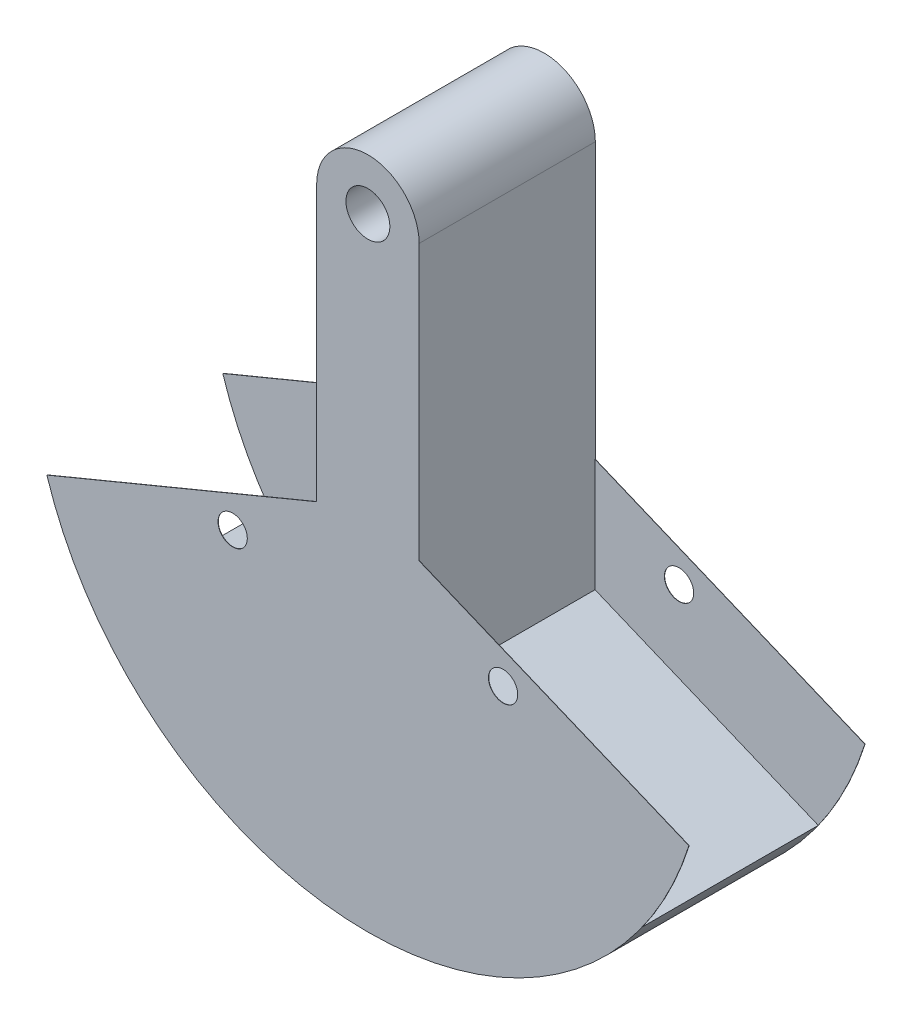
ISO-10303-21;
HEADER;
FILE_DESCRIPTION(('STEP AP214'),'2;1');
FILE_NAME('part.step','',(''),(''),'','','');
FILE_SCHEMA(('AUTOMOTIVE_DESIGN { 1 0 10303 214 1 1 1 1 }'));
ENDSEC;
DATA;
#1=APPLICATION_CONTEXT('core data for automotive mechanical design processes');
#2=APPLICATION_PROTOCOL_DEFINITION('international standard','automotive_design',2000,#1);
#3=PRODUCT_CONTEXT('',#1,'mechanical');
#4=PRODUCT('Part','Part','',(#3));
#5=PRODUCT_RELATED_PRODUCT_CATEGORY('part','',(#4));
#6=PRODUCT_DEFINITION_FORMATION('','',#4);
#7=PRODUCT_DEFINITION_CONTEXT('part definition',#1,'design');
#8=PRODUCT_DEFINITION('design','',#6,#7);
#9=PRODUCT_DEFINITION_SHAPE('','',#8);
#10=(LENGTH_UNIT() NAMED_UNIT(*) SI_UNIT(.MILLI.,.METRE.));
#11=(NAMED_UNIT(*) PLANE_ANGLE_UNIT() SI_UNIT($,.RADIAN.));
#12=(NAMED_UNIT(*) SI_UNIT($,.STERADIAN.) SOLID_ANGLE_UNIT());
#13=UNCERTAINTY_MEASURE_WITH_UNIT(LENGTH_MEASURE(1.E-05),#10,'distance_accuracy_value','');
#14=(GEOMETRIC_REPRESENTATION_CONTEXT(3) GLOBAL_UNCERTAINTY_ASSIGNED_CONTEXT((#13)) GLOBAL_UNIT_ASSIGNED_CONTEXT((#10,
#11,#12)) REPRESENTATION_CONTEXT('',''));
#15=CARTESIAN_POINT('',(0.,0.,0.));
#16=DIRECTION('',(0.,0.,1.));
#17=DIRECTION('',(1.,0.,0.));
#18=AXIS2_PLACEMENT_3D('',#15,#16,#17);
#19=CARTESIAN_POINT('',(24.921344635613,-60.1654482118713,76.2));
#20=DIRECTION('',(0.382683432365087,-0.923879532511288,0.));
#21=DIRECTION('',(0.923879532511288,0.382683432365087,0.));
#22=AXIS2_PLACEMENT_3D('',#19,#20,#21);
#23=PLANE('',#22);
#24=DIRECTION('',(-0.923879532511288,-0.382683432365087,0.));
#25=VECTOR('',#24,1.);
#26=CARTESIAN_POINT('',(24.921344635613,-60.1654482118713,-76.2));
#27=LINE('',#26,#25);
#28=CARTESIAN_POINT('',(-44.45,-88.9,-76.2));
#29=VERTEX_POINT('',#28);
#30=CARTESIAN_POINT('',(-238.151556269353,-169.133811659541,-76.2));
#31=VERTEX_POINT('',#30);
#32=EDGE_CURVE('E210',#29,#31,#27,.T.);
#33=ORIENTED_EDGE('',*,*,#32,.T.);
#34=DIRECTION('',(0.,0.,-1.));
#35=VECTOR('',#34,1.);
#36=CARTESIAN_POINT('',(-238.151556269353,-169.133811659541,76.2));
#37=LINE('',#36,#35);
#38=CARTESIAN_POINT('',(-238.151556269353,-169.133811659541,76.2));
#39=VERTEX_POINT('',#38);
#40=EDGE_CURVE('E11',#39,#31,#37,.T.);
#41=ORIENTED_EDGE('',*,*,#40,.F.);
#42=DIRECTION('',(-0.923879532511288,-0.382683432365087,0.));
#43=VECTOR('',#42,1.);
#44=CARTESIAN_POINT('',(24.921344635613,-60.1654482118713,76.2));
#45=LINE('',#44,#43);
#46=CARTESIAN_POINT('',(-44.45,-88.9,76.2));
#47=VERTEX_POINT('',#46);
#48=EDGE_CURVE('E260',#47,#39,#45,.T.);
#49=ORIENTED_EDGE('',*,*,#48,.F.);
#50=DIRECTION('',(0.,0.,-1.));
#51=VECTOR('',#50,1.);
#52=CARTESIAN_POINT('',(-44.45,-88.9,76.2));
#53=LINE('',#52,#51);
#54=EDGE_CURVE('E277',#47,#29,#53,.T.);
#55=ORIENTED_EDGE('',*,*,#54,.T.);
#56=EDGE_LOOP('',(#33,#41,#49,#55));
#57=FACE_BOUND('',#56,.T.);
#58=ADVANCED_FACE('F37',(#57),#23,.F.);
#59=CARTESIAN_POINT('',(0.,0.,76.2));
#60=DIRECTION('',(0.,0.,-1.));
#61=DIRECTION('',(-1.,0.,0.));
#62=AXIS2_PLACEMENT_3D('',#59,#60,#61);
#63=CYLINDRICAL_SURFACE('',#62,292.1);
#64=ORIENTED_EDGE('',*,*,#40,.T.);
#65=CARTESIAN_POINT('',(0.,0.,-76.2));
#66=DIRECTION('',(0.,0.,1.));
#67=DIRECTION('',(1.,0.,0.));
#68=AXIS2_PLACEMENT_3D('',#65,#66,#67);
#69=CIRCLE('',#68,292.1);
#70=CARTESIAN_POINT('',(-278.563150244914,-87.8918729213896,-76.2));
#71=VERTEX_POINT('',#70);
#72=EDGE_CURVE('E188',#71,#31,#69,.T.);
#73=ORIENTED_EDGE('',*,*,#72,.F.);
#74=DIRECTION('',(0.,0.,1.));
#75=VECTOR('',#74,1.);
#76=CARTESIAN_POINT('',(-278.563150244914,-87.8918729213896,-76.454));
#77=LINE('',#76,#75);
#78=CARTESIAN_POINT('',(-278.563150244914,-87.8918729213896,-76.454));
#79=VERTEX_POINT('',#78);
#80=EDGE_CURVE('E181',#79,#71,#77,.T.);
#81=ORIENTED_EDGE('',*,*,#80,.F.);
#82=CARTESIAN_POINT('',(0.,0.,-76.454));
#83=DIRECTION('',(0.,0.,1.));
#84=DIRECTION('',(1.,0.,0.));
#85=AXIS2_PLACEMENT_3D('',#82,#83,#84);
#86=CIRCLE('',#85,292.1);
#87=CARTESIAN_POINT('',(278.563150244914,-87.8918729213896,-76.454));
#88=VERTEX_POINT('',#87);
#89=EDGE_CURVE('E168',#79,#88,#86,.T.);
#90=ORIENTED_EDGE('',*,*,#89,.T.);
#91=DIRECTION('',(0.,0.,1.));
#92=VECTOR('',#91,1.);
#93=CARTESIAN_POINT('',(278.563150244914,-87.8918729213896,-76.454));
#94=LINE('',#93,#92);
#95=CARTESIAN_POINT('',(278.563150244914,-87.8918729213896,-76.2));
#96=VERTEX_POINT('',#95);
#97=EDGE_CURVE('E190',#88,#96,#94,.T.);
#98=ORIENTED_EDGE('',*,*,#97,.T.);
#99=CARTESIAN_POINT('',(238.151556269353,-169.133811659541,-76.2));
#100=VERTEX_POINT('',#99);
#101=EDGE_CURVE('E185',#100,#96,#69,.T.);
#102=ORIENTED_EDGE('',*,*,#101,.F.);
#103=DIRECTION('',(0.,0.,-1.));
#104=VECTOR('',#103,1.);
#105=CARTESIAN_POINT('',(238.151556269353,-169.133811659541,76.2));
#106=LINE('',#105,#104);
#107=CARTESIAN_POINT('',(238.151556269353,-169.133811659541,76.2));
#108=VERTEX_POINT('',#107);
#109=EDGE_CURVE('E46',#108,#100,#106,.T.);
#110=ORIENTED_EDGE('',*,*,#109,.F.);
#111=CARTESIAN_POINT('',(0.,0.,76.2));
#112=DIRECTION('',(0.,0.,1.));
#113=DIRECTION('',(1.,0.,0.));
#114=AXIS2_PLACEMENT_3D('',#111,#112,#113);
#115=CIRCLE('',#114,292.1);
#116=CARTESIAN_POINT('',(278.563150244914,-87.8918729213896,76.2));
#117=VERTEX_POINT('',#116);
#118=EDGE_CURVE('E237',#108,#117,#115,.T.);
#119=ORIENTED_EDGE('',*,*,#118,.T.);
#120=DIRECTION('',(0.,0.,-1.));
#121=VECTOR('',#120,1.);
#122=CARTESIAN_POINT('',(278.563150244914,-87.8918729213896,76.454));
#123=LINE('',#122,#121);
#124=CARTESIAN_POINT('',(278.563150244914,-87.8918729213896,76.454));
#125=VERTEX_POINT('',#124);
#126=EDGE_CURVE('E226',#125,#117,#123,.T.);
#127=ORIENTED_EDGE('',*,*,#126,.F.);
#128=CARTESIAN_POINT('',(0.,0.,76.454));
#129=DIRECTION('',(0.,0.,1.));
#130=DIRECTION('',(1.,0.,0.));
#131=AXIS2_PLACEMENT_3D('',#128,#129,#130);
#132=CIRCLE('',#131,292.1);
#133=CARTESIAN_POINT('',(-278.563150244914,-87.8918729213896,76.454));
#134=VERTEX_POINT('',#133);
#135=EDGE_CURVE('E545',#134,#125,#132,.T.);
#136=ORIENTED_EDGE('',*,*,#135,.F.);
#137=DIRECTION('',(0.,0.,-1.));
#138=VECTOR('',#137,1.);
#139=CARTESIAN_POINT('',(-278.563150244914,-87.8918729213896,76.454));
#140=LINE('',#139,#138);
#141=CARTESIAN_POINT('',(-278.563150244914,-87.8918729213896,76.2));
#142=VERTEX_POINT('',#141);
#143=EDGE_CURVE('E219',#134,#142,#140,.T.);
#144=ORIENTED_EDGE('',*,*,#143,.T.);
#145=EDGE_CURVE('E244',#142,#39,#115,.T.);
#146=ORIENTED_EDGE('',*,*,#145,.T.);
#147=EDGE_LOOP('',(#64,#73,#81,#90,#98,#102,#110,#119,#127,#136,#144,#146));
#148=FACE_BOUND('',#147,.T.);
#149=ADVANCED_FACE('F323',(#148),#63,.T.);
#150=CARTESIAN_POINT('',(-24.921344635613,-60.1654482118713,76.2));
#151=DIRECTION('',(0.382683432365087,0.923879532511288,0.));
#152=DIRECTION('',(-0.923879532511288,0.382683432365087,0.));
#153=AXIS2_PLACEMENT_3D('',#150,#151,#152);
#154=PLANE('',#153);
#155=DIRECTION('',(0.923879532511288,-0.382683432365087,0.));
#156=VECTOR('',#155,1.);
#157=CARTESIAN_POINT('',(-24.921344635613,-60.1654482118713,-76.2));
#158=LINE('',#157,#156);
#159=CARTESIAN_POINT('',(44.4500000000001,-88.9,-76.2));
#160=VERTEX_POINT('',#159);
#161=EDGE_CURVE('E212',#160,#100,#158,.T.);
#162=ORIENTED_EDGE('',*,*,#161,.F.);
#163=DIRECTION('',(0.,0.,-1.));
#164=VECTOR('',#163,1.);
#165=CARTESIAN_POINT('',(44.4500000000001,-88.9,76.2));
#166=LINE('',#165,#164);
#167=CARTESIAN_POINT('',(44.4500000000001,-88.9,76.2));
#168=VERTEX_POINT('',#167);
#169=EDGE_CURVE('E150',#168,#160,#166,.T.);
#170=ORIENTED_EDGE('',*,*,#169,.F.);
#171=DIRECTION('',(0.923879532511288,-0.382683432365087,0.));
#172=VECTOR('',#171,1.);
#173=CARTESIAN_POINT('',(-24.921344635613,-60.1654482118713,76.2));
#174=LINE('',#173,#172);
#175=EDGE_CURVE('E256',#168,#108,#174,.T.);
#176=ORIENTED_EDGE('',*,*,#175,.T.);
#177=ORIENTED_EDGE('',*,*,#109,.T.);
#178=EDGE_LOOP('',(#162,#170,#176,#177));
#179=FACE_BOUND('',#178,.T.);
#180=ADVANCED_FACE('F327',(#179),#154,.T.);
#181=CARTESIAN_POINT('',(44.45,0.,76.2));
#182=DIRECTION('',(1.,0.,0.));
#183=DIRECTION('',(0.,1.,0.));
#184=AXIS2_PLACEMENT_3D('',#181,#182,#183);
#185=PLANE('',#184);
#186=DIRECTION('',(0.,-1.,0.));
#187=VECTOR('',#186,1.);
#188=CARTESIAN_POINT('',(44.45,0.,-76.2));
#189=LINE('',#188,#187);
#190=CARTESIAN_POINT('',(44.45,9.08096903994286,-76.2));
#191=VERTEX_POINT('',#190);
#192=EDGE_CURVE('E54',#191,#160,#189,.T.);
#193=ORIENTED_EDGE('',*,*,#192,.F.);
#194=DIRECTION('',(0.,0.,1.));
#195=VECTOR('',#194,1.);
#196=CARTESIAN_POINT('',(44.45,9.08096903994286,-76.454));
#197=LINE('',#196,#195);
#198=CARTESIAN_POINT('',(44.45,9.08096903994286,-76.454));
#199=VERTEX_POINT('',#198);
#200=EDGE_CURVE('E165',#199,#191,#197,.T.);
#201=ORIENTED_EDGE('',*,*,#200,.F.);
#202=DIRECTION('',(0.,1.,0.));
#203=VECTOR('',#202,1.);
#204=CARTESIAN_POINT('',(44.4500000000002,247.65,-76.454));
#205=LINE('',#204,#203);
#206=CARTESIAN_POINT('',(44.4500000000002,247.65,-76.454));
#207=VERTEX_POINT('',#206);
#208=EDGE_CURVE('E157',#199,#207,#205,.T.);
#209=ORIENTED_EDGE('',*,*,#208,.T.);
#210=DIRECTION('',(0.,0.,-1.));
#211=VECTOR('',#210,1.);
#212=CARTESIAN_POINT('',(44.45,247.65,76.2));
#213=LINE('',#212,#211);
#214=CARTESIAN_POINT('',(44.4500000000002,247.65,76.454));
#215=VERTEX_POINT('',#214);
#216=EDGE_CURVE('E140',#215,#207,#213,.T.);
#217=ORIENTED_EDGE('',*,*,#216,.F.);
#218=DIRECTION('',(0.,1.,0.));
#219=VECTOR('',#218,1.);
#220=CARTESIAN_POINT('',(44.4500000000002,247.65,76.454));
#221=LINE('',#220,#219);
#222=CARTESIAN_POINT('',(44.45,9.08096903994286,76.454));
#223=VERTEX_POINT('',#222);
#224=EDGE_CURVE('E250',#223,#215,#221,.T.);
#225=ORIENTED_EDGE('',*,*,#224,.F.);
#226=DIRECTION('',(0.,0.,-1.));
#227=VECTOR('',#226,1.);
#228=CARTESIAN_POINT('',(44.45,9.08096903994286,76.454));
#229=LINE('',#228,#227);
#230=CARTESIAN_POINT('',(44.45,9.08096903994286,76.2));
#231=VERTEX_POINT('',#230);
#232=EDGE_CURVE('E247',#223,#231,#229,.T.);
#233=ORIENTED_EDGE('',*,*,#232,.T.);
#234=DIRECTION('',(0.,-1.,0.));
#235=VECTOR('',#234,1.);
#236=CARTESIAN_POINT('',(44.45,0.,76.2));
#237=LINE('',#236,#235);
#238=EDGE_CURVE('E259',#231,#168,#237,.T.);
#239=ORIENTED_EDGE('',*,*,#238,.T.);
#240=ORIENTED_EDGE('',*,*,#169,.T.);
#241=EDGE_LOOP('',(#193,#201,#209,#217,#225,#233,#239,#240));
#242=FACE_BOUND('',#241,.T.);
#243=ADVANCED_FACE('F164',(#242),#185,.T.);
#244=CARTESIAN_POINT('',(0.,247.65,76.2));
#245=DIRECTION('',(0.,0.,-1.));
#246=DIRECTION('',(-1.,0.,0.));
#247=AXIS2_PLACEMENT_3D('',#244,#245,#246);
#248=CYLINDRICAL_SURFACE('',#247,44.45);
#249=ORIENTED_EDGE('',*,*,#216,.T.);
#250=CARTESIAN_POINT('',(0.,247.65,-76.454));
#251=DIRECTION('',(0.,0.,1.));
#252=DIRECTION('',(1.,0.,0.));
#253=AXIS2_PLACEMENT_3D('',#250,#251,#252);
#254=CIRCLE('',#253,44.4500000000002);
#255=CARTESIAN_POINT('',(-44.4500000000002,247.65,-76.454));
#256=VERTEX_POINT('',#255);
#257=EDGE_CURVE('E143',#207,#256,#254,.T.);
#258=ORIENTED_EDGE('',*,*,#257,.T.);
#259=DIRECTION('',(0.,0.,-1.));
#260=VECTOR('',#259,1.);
#261=CARTESIAN_POINT('',(-44.45,247.65,76.2));
#262=LINE('',#261,#260);
#263=CARTESIAN_POINT('',(-44.4500000000002,247.65,76.454));
#264=VERTEX_POINT('',#263);
#265=EDGE_CURVE('E151',#264,#256,#262,.T.);
#266=ORIENTED_EDGE('',*,*,#265,.F.);
#267=CARTESIAN_POINT('',(0.,247.65,76.454));
#268=DIRECTION('',(0.,0.,1.));
#269=DIRECTION('',(1.,0.,0.));
#270=AXIS2_PLACEMENT_3D('',#267,#268,#269);
#271=CIRCLE('',#270,44.4500000000002);
#272=EDGE_CURVE('E146',#215,#264,#271,.T.);
#273=ORIENTED_EDGE('',*,*,#272,.F.);
#274=EDGE_LOOP('',(#249,#258,#266,#273));
#275=FACE_BOUND('',#274,.T.);
#276=ADVANCED_FACE('F142',(#275),#248,.T.);
#277=CARTESIAN_POINT('',(0.,247.65,76.2));
#278=DIRECTION('',(0.,0.,-1.));
#279=DIRECTION('',(-1.,0.,0.));
#280=AXIS2_PLACEMENT_3D('',#277,#278,#279);
#281=CYLINDRICAL_SURFACE('',#280,19.05);
#282=CARTESIAN_POINT('',(0.,247.65,76.454));
#283=DIRECTION('',(0.,0.,1.));
#284=DIRECTION('',(1.,0.,0.));
#285=AXIS2_PLACEMENT_3D('',#282,#283,#284);
#286=CIRCLE('',#285,19.0500000000001);
#287=CARTESIAN_POINT('',(19.0500000000001,247.65,76.454));
#288=VERTEX_POINT('',#287);
#289=EDGE_CURVE('E195',#288,#288,#286,.T.);
#290=ORIENTED_EDGE('',*,*,#289,.T.);
#291=EDGE_LOOP('',(#290));
#292=FACE_BOUND('',#291,.T.);
#293=CARTESIAN_POINT('',(0.,247.65,-76.454));
#294=DIRECTION('',(0.,0.,1.));
#295=DIRECTION('',(1.,0.,0.));
#296=AXIS2_PLACEMENT_3D('',#293,#294,#295);
#297=CIRCLE('',#296,19.0500000000001);
#298=CARTESIAN_POINT('',(19.0500000000001,247.65,-76.454));
#299=VERTEX_POINT('',#298);
#300=EDGE_CURVE('E303',#299,#299,#297,.T.);
#301=ORIENTED_EDGE('',*,*,#300,.F.);
#302=EDGE_LOOP('',(#301));
#303=FACE_BOUND('',#302,.T.);
#304=ADVANCED_FACE('F39',(#292,#303),#281,.F.);
#305=CARTESIAN_POINT('',(-44.45,0.,76.2));
#306=DIRECTION('',(1.,0.,0.));
#307=DIRECTION('',(0.,1.,0.));
#308=AXIS2_PLACEMENT_3D('',#305,#306,#307);
#309=PLANE('',#308);
#310=ORIENTED_EDGE('',*,*,#265,.T.);
#311=DIRECTION('',(0.,-1.,0.));
#312=VECTOR('',#311,1.);
#313=CARTESIAN_POINT('',(-44.4500000000002,247.65,-76.454));
#314=LINE('',#313,#312);
#315=CARTESIAN_POINT('',(-44.45,9.08096903994285,-76.454));
#316=VERTEX_POINT('',#315);
#317=EDGE_CURVE('E161',#256,#316,#314,.T.);
#318=ORIENTED_EDGE('',*,*,#317,.T.);
#319=DIRECTION('',(0.,0.,1.));
#320=VECTOR('',#319,1.);
#321=CARTESIAN_POINT('',(-44.45,9.08096903994285,-76.454));
#322=LINE('',#321,#320);
#323=CARTESIAN_POINT('',(-44.45,9.08096903994285,-76.2));
#324=VERTEX_POINT('',#323);
#325=EDGE_CURVE('E178',#316,#324,#322,.T.);
#326=ORIENTED_EDGE('',*,*,#325,.T.);
#327=DIRECTION('',(0.,-1.,0.));
#328=VECTOR('',#327,1.);
#329=CARTESIAN_POINT('',(-44.45,0.,-76.2));
#330=LINE('',#329,#328);
#331=EDGE_CURVE('E62',#324,#29,#330,.T.);
#332=ORIENTED_EDGE('',*,*,#331,.T.);
#333=ORIENTED_EDGE('',*,*,#54,.F.);
#334=DIRECTION('',(0.,-1.,0.));
#335=VECTOR('',#334,1.);
#336=CARTESIAN_POINT('',(-44.45,0.,76.2));
#337=LINE('',#336,#335);
#338=CARTESIAN_POINT('',(-44.45,9.08096903994285,76.2));
#339=VERTEX_POINT('',#338);
#340=EDGE_CURVE('E230',#339,#47,#337,.T.);
#341=ORIENTED_EDGE('',*,*,#340,.F.);
#342=DIRECTION('',(0.,0.,-1.));
#343=VECTOR('',#342,1.);
#344=CARTESIAN_POINT('',(-44.45,9.08096903994285,76.454));
#345=LINE('',#344,#343);
#346=CARTESIAN_POINT('',(-44.45,9.08096903994285,76.454));
#347=VERTEX_POINT('',#346);
#348=EDGE_CURVE('E213',#347,#339,#345,.T.);
#349=ORIENTED_EDGE('',*,*,#348,.F.);
#350=DIRECTION('',(0.,-1.,0.));
#351=VECTOR('',#350,1.);
#352=CARTESIAN_POINT('',(-44.4500000000002,247.65,76.454));
#353=LINE('',#352,#351);
#354=EDGE_CURVE('E550',#264,#347,#353,.T.);
#355=ORIENTED_EDGE('',*,*,#354,.F.);
#356=EDGE_LOOP('',(#310,#318,#326,#332,#333,#341,#349,#355));
#357=FACE_BOUND('',#356,.T.);
#358=ADVANCED_FACE('F312',(#357),#309,.F.);
#359=CARTESIAN_POINT('',(0.,247.65,76.2));
#360=DIRECTION('',(0.,0.,1.));
#361=DIRECTION('',(1.,0.,0.));
#362=AXIS2_PLACEMENT_3D('',#359,#360,#361);
#363=PLANE('',#362);
#364=CARTESIAN_POINT('',(-117.332700628934,-48.6007959103661,76.2));
#365=DIRECTION('',(0.,0.,1.));
#366=DIRECTION('',(1.,0.,0.));
#367=AXIS2_PLACEMENT_3D('',#364,#365,#366);
#368=CIRCLE('',#367,12.6999999999999);
#369=CARTESIAN_POINT('',(-104.632700628934,-48.6007959103661,76.2));
#370=VERTEX_POINT('',#369);
#371=EDGE_CURVE('E518',#370,#370,#368,.T.);
#372=ORIENTED_EDGE('',*,*,#371,.T.);
#373=EDGE_LOOP('',(#372));
#374=FACE_BOUND('',#373,.T.);
#375=ORIENTED_EDGE('',*,*,#340,.T.);
#376=ORIENTED_EDGE('',*,*,#48,.T.);
#377=ORIENTED_EDGE('',*,*,#145,.F.);
#378=DIRECTION('',(-0.923879532511288,-0.382683432365087,0.));
#379=VECTOR('',#378,1.);
#380=CARTESIAN_POINT('',(-44.45,9.08096903994285,76.2));
#381=LINE('',#380,#379);
#382=EDGE_CURVE('E235',#339,#142,#381,.T.);
#383=ORIENTED_EDGE('',*,*,#382,.F.);
#384=EDGE_LOOP('',(#375,#376,#377,#383));
#385=FACE_BOUND('',#384,.T.);
#386=ADVANCED_FACE('F318',(#374,#385),#363,.F.);
#387=CARTESIAN_POINT('',(0.,247.65,76.454));
#388=DIRECTION('',(0.,0.,1.));
#389=DIRECTION('',(1.,0.,0.));
#390=AXIS2_PLACEMENT_3D('',#387,#388,#389);
#391=PLANE('',#390);
#392=CARTESIAN_POINT('',(117.332700628933,-48.6007959103669,76.454));
#393=DIRECTION('',(0.,0.,1.));
#394=DIRECTION('',(1.,0.,0.));
#395=AXIS2_PLACEMENT_3D('',#392,#393,#394);
#396=CIRCLE('',#395,12.7);
#397=CARTESIAN_POINT('',(130.032700628933,-48.6007959103669,76.454));
#398=VERTEX_POINT('',#397);
#399=EDGE_CURVE('E554',#398,#398,#396,.T.);
#400=ORIENTED_EDGE('',*,*,#399,.F.);
#401=EDGE_LOOP('',(#400));
#402=FACE_BOUND('',#401,.T.);
#403=ORIENTED_EDGE('',*,*,#272,.T.);
#404=ORIENTED_EDGE('',*,*,#354,.T.);
#405=DIRECTION('',(-0.923879532511288,-0.382683432365087,0.));
#406=VECTOR('',#405,1.);
#407=CARTESIAN_POINT('',(-44.45,9.08096903994285,76.454));
#408=LINE('',#407,#406);
#409=EDGE_CURVE('E546',#347,#134,#408,.T.);
#410=ORIENTED_EDGE('',*,*,#409,.T.);
#411=ORIENTED_EDGE('',*,*,#135,.T.);
#412=DIRECTION('',(-0.923879532511288,0.382683432365087,0.));
#413=VECTOR('',#412,1.);
#414=CARTESIAN_POINT('',(44.45,9.08096903994286,76.454));
#415=LINE('',#414,#413);
#416=EDGE_CURVE('E538',#125,#223,#415,.T.);
#417=ORIENTED_EDGE('',*,*,#416,.T.);
#418=ORIENTED_EDGE('',*,*,#224,.T.);
#419=EDGE_LOOP('',(#403,#404,#410,#411,#417,#418));
#420=FACE_BOUND('',#419,.T.);
#421=CARTESIAN_POINT('',(-117.332700628934,-48.6007959103661,76.454));
#422=DIRECTION('',(0.,0.,1.));
#423=DIRECTION('',(1.,0.,0.));
#424=AXIS2_PLACEMENT_3D('',#421,#422,#423);
#425=CIRCLE('',#424,12.6999999999999);
#426=CARTESIAN_POINT('',(-104.632700628934,-48.6007959103661,76.454));
#427=VERTEX_POINT('',#426);
#428=EDGE_CURVE('E238',#427,#427,#425,.T.);
#429=ORIENTED_EDGE('',*,*,#428,.F.);
#430=EDGE_LOOP('',(#429));
#431=FACE_BOUND('',#430,.T.);
#432=ORIENTED_EDGE('',*,*,#289,.F.);
#433=EDGE_LOOP('',(#432));
#434=FACE_BOUND('',#433,.T.);
#435=ADVANCED_FACE('F346',(#402,#420,#431,#434),#391,.T.);
#436=ORIENTED_EDGE('',*,*,#175,.F.);
#437=ORIENTED_EDGE('',*,*,#238,.F.);
#438=DIRECTION('',(-0.923879532511288,0.382683432365087,0.));
#439=VECTOR('',#438,1.);
#440=CARTESIAN_POINT('',(44.45,9.08096903994286,76.2));
#441=LINE('',#440,#439);
#442=EDGE_CURVE('E241',#117,#231,#441,.T.);
#443=ORIENTED_EDGE('',*,*,#442,.F.);
#444=ORIENTED_EDGE('',*,*,#118,.F.);
#445=EDGE_LOOP('',(#436,#437,#443,#444));
#446=FACE_BOUND('',#445,.T.);
#447=CARTESIAN_POINT('',(117.332700628933,-48.6007959103669,76.2));
#448=DIRECTION('',(0.,0.,1.));
#449=DIRECTION('',(1.,0.,0.));
#450=AXIS2_PLACEMENT_3D('',#447,#448,#449);
#451=CIRCLE('',#450,12.7);
#452=CARTESIAN_POINT('',(130.032700628933,-48.6007959103669,76.2));
#453=VERTEX_POINT('',#452);
#454=EDGE_CURVE('E557',#453,#453,#451,.T.);
#455=ORIENTED_EDGE('',*,*,#454,.T.);
#456=EDGE_LOOP('',(#455));
#457=FACE_BOUND('',#456,.T.);
#458=ADVANCED_FACE('F339',(#446,#457),#363,.F.);
#459=CARTESIAN_POINT('',(-44.45,9.08096903994285,76.454));
#460=DIRECTION('',(0.382683432365087,-0.923879532511288,0.));
#461=DIRECTION('',(0.923879532511288,0.382683432365087,0.));
#462=AXIS2_PLACEMENT_3D('',#459,#460,#461);
#463=PLANE('',#462);
#464=ORIENTED_EDGE('',*,*,#382,.T.);
#465=ORIENTED_EDGE('',*,*,#143,.F.);
#466=ORIENTED_EDGE('',*,*,#409,.F.);
#467=ORIENTED_EDGE('',*,*,#348,.T.);
#468=EDGE_LOOP('',(#464,#465,#466,#467));
#469=FACE_BOUND('',#468,.T.);
#470=ADVANCED_FACE('F335',(#469),#463,.F.);
#471=CARTESIAN_POINT('',(44.45,9.08096903994286,76.454));
#472=DIRECTION('',(-0.382683432365087,-0.923879532511288,0.));
#473=DIRECTION('',(0.923879532511288,-0.382683432365087,0.));
#474=AXIS2_PLACEMENT_3D('',#471,#472,#473);
#475=PLANE('',#474);
#476=ORIENTED_EDGE('',*,*,#442,.T.);
#477=ORIENTED_EDGE('',*,*,#232,.F.);
#478=ORIENTED_EDGE('',*,*,#416,.F.);
#479=ORIENTED_EDGE('',*,*,#126,.T.);
#480=EDGE_LOOP('',(#476,#477,#478,#479));
#481=FACE_BOUND('',#480,.T.);
#482=ADVANCED_FACE('F338',(#481),#475,.F.);
#483=CARTESIAN_POINT('',(-117.332700628934,-48.6007959103661,76.454));
#484=DIRECTION('',(0.,0.,-1.));
#485=DIRECTION('',(-1.,0.,0.));
#486=AXIS2_PLACEMENT_3D('',#483,#484,#485);
#487=CYLINDRICAL_SURFACE('',#486,12.6999999999999);
#488=ORIENTED_EDGE('',*,*,#428,.T.);
#489=EDGE_LOOP('',(#488));
#490=FACE_BOUND('',#489,.T.);
#491=ORIENTED_EDGE('',*,*,#371,.F.);
#492=EDGE_LOOP('',(#491));
#493=FACE_BOUND('',#492,.T.);
#494=ADVANCED_FACE('F342',(#490,#493),#487,.F.);
#495=CARTESIAN_POINT('',(117.332700628933,-48.6007959103669,76.454));
#496=DIRECTION('',(0.,0.,-1.));
#497=DIRECTION('',(-1.,0.,0.));
#498=AXIS2_PLACEMENT_3D('',#495,#496,#497);
#499=CYLINDRICAL_SURFACE('',#498,12.7);
#500=ORIENTED_EDGE('',*,*,#399,.T.);
#501=EDGE_LOOP('',(#500));
#502=FACE_BOUND('',#501,.T.);
#503=ORIENTED_EDGE('',*,*,#454,.F.);
#504=EDGE_LOOP('',(#503));
#505=FACE_BOUND('',#504,.T.);
#506=ADVANCED_FACE('F353',(#502,#505),#499,.F.);
#507=CARTESIAN_POINT('',(0.,247.65,-76.2));
#508=DIRECTION('',(0.,0.,-1.));
#509=DIRECTION('',(1.,0.,0.));
#510=AXIS2_PLACEMENT_3D('',#507,#508,#509);
#511=PLANE('',#510);
#512=CARTESIAN_POINT('',(117.332700628933,-48.6007959103669,-76.2));
#513=DIRECTION('',(0.,0.,1.));
#514=DIRECTION('',(1.,0.,0.));
#515=AXIS2_PLACEMENT_3D('',#512,#513,#514);
#516=CIRCLE('',#515,12.7);
#517=CARTESIAN_POINT('',(130.032700628933,-48.6007959103669,-76.2));
#518=VERTEX_POINT('',#517);
#519=EDGE_CURVE('E300',#518,#518,#516,.T.);
#520=ORIENTED_EDGE('',*,*,#519,.F.);
#521=EDGE_LOOP('',(#520));
#522=FACE_BOUND('',#521,.T.);
#523=DIRECTION('',(-0.923879532511288,0.382683432365087,0.));
#524=VECTOR('',#523,1.);
#525=CARTESIAN_POINT('',(44.45,9.08096903994286,-76.2));
#526=LINE('',#525,#524);
#527=EDGE_CURVE('E288',#96,#191,#526,.T.);
#528=ORIENTED_EDGE('',*,*,#527,.T.);
#529=ORIENTED_EDGE('',*,*,#192,.T.);
#530=ORIENTED_EDGE('',*,*,#161,.T.);
#531=ORIENTED_EDGE('',*,*,#101,.T.);
#532=EDGE_LOOP('',(#528,#529,#530,#531));
#533=FACE_BOUND('',#532,.T.);
#534=ADVANCED_FACE('F357',(#522,#533),#511,.F.);
#535=CARTESIAN_POINT('',(44.45,9.08096903994286,-76.454));
#536=DIRECTION('',(0.382683432365087,0.923879532511288,0.));
#537=DIRECTION('',(-0.923879532511288,0.382683432365087,0.));
#538=AXIS2_PLACEMENT_3D('',#535,#536,#537);
#539=PLANE('',#538);
#540=ORIENTED_EDGE('',*,*,#527,.F.);
#541=ORIENTED_EDGE('',*,*,#97,.F.);
#542=DIRECTION('',(-0.923879532511288,0.382683432365087,0.));
#543=VECTOR('',#542,1.);
#544=CARTESIAN_POINT('',(44.45,9.08096903994286,-76.454));
#545=LINE('',#544,#543);
#546=EDGE_CURVE('E166',#88,#199,#545,.T.);
#547=ORIENTED_EDGE('',*,*,#546,.T.);
#548=ORIENTED_EDGE('',*,*,#200,.T.);
#549=EDGE_LOOP('',(#540,#541,#547,#548));
#550=FACE_BOUND('',#549,.T.);
#551=ADVANCED_FACE('F359',(#550),#539,.T.);
#552=CARTESIAN_POINT('',(-44.45,9.08096903994285,-76.454));
#553=DIRECTION('',(-0.382683432365087,0.923879532511288,0.));
#554=DIRECTION('',(-0.923879532511288,-0.382683432365087,0.));
#555=AXIS2_PLACEMENT_3D('',#552,#553,#554);
#556=PLANE('',#555);
#557=DIRECTION('',(-0.923879532511288,-0.382683432365087,0.));
#558=VECTOR('',#557,1.);
#559=CARTESIAN_POINT('',(-44.45,9.08096903994285,-76.2));
#560=LINE('',#559,#558);
#561=EDGE_CURVE('E162',#324,#71,#560,.T.);
#562=ORIENTED_EDGE('',*,*,#561,.F.);
#563=ORIENTED_EDGE('',*,*,#325,.F.);
#564=DIRECTION('',(-0.923879532511288,-0.382683432365087,0.));
#565=VECTOR('',#564,1.);
#566=CARTESIAN_POINT('',(-44.45,9.08096903994285,-76.454));
#567=LINE('',#566,#565);
#568=EDGE_CURVE('E174',#316,#79,#567,.T.);
#569=ORIENTED_EDGE('',*,*,#568,.T.);
#570=ORIENTED_EDGE('',*,*,#80,.T.);
#571=EDGE_LOOP('',(#562,#563,#569,#570));
#572=FACE_BOUND('',#571,.T.);
#573=ADVANCED_FACE('F362',(#572),#556,.T.);
#574=CARTESIAN_POINT('',(0.,247.65,-76.454));
#575=DIRECTION('',(0.,0.,-1.));
#576=DIRECTION('',(1.,0.,0.));
#577=AXIS2_PLACEMENT_3D('',#574,#575,#576);
#578=PLANE('',#577);
#579=ORIENTED_EDGE('',*,*,#300,.T.);
#580=EDGE_LOOP('',(#579));
#581=FACE_BOUND('',#580,.T.);
#582=CARTESIAN_POINT('',(117.332700628933,-48.6007959103669,-76.454));
#583=DIRECTION('',(0.,0.,1.));
#584=DIRECTION('',(1.,0.,0.));
#585=AXIS2_PLACEMENT_3D('',#582,#583,#584);
#586=CIRCLE('',#585,12.7);
#587=CARTESIAN_POINT('',(130.032700628933,-48.6007959103669,-76.454));
#588=VERTEX_POINT('',#587);
#589=EDGE_CURVE('E298',#588,#588,#586,.T.);
#590=ORIENTED_EDGE('',*,*,#589,.T.);
#591=EDGE_LOOP('',(#590));
#592=FACE_BOUND('',#591,.T.);
#593=CARTESIAN_POINT('',(-117.332700628934,-48.6007959103661,-76.454));
#594=DIRECTION('',(0.,0.,1.));
#595=DIRECTION('',(1.,0.,0.));
#596=AXIS2_PLACEMENT_3D('',#593,#594,#595);
#597=CIRCLE('',#596,12.6999999999999);
#598=CARTESIAN_POINT('',(-104.632700628934,-48.6007959103661,-76.454));
#599=VERTEX_POINT('',#598);
#600=EDGE_CURVE('E290',#599,#599,#597,.T.);
#601=ORIENTED_EDGE('',*,*,#600,.T.);
#602=EDGE_LOOP('',(#601));
#603=FACE_BOUND('',#602,.T.);
#604=ORIENTED_EDGE('',*,*,#257,.F.);
#605=ORIENTED_EDGE('',*,*,#208,.F.);
#606=ORIENTED_EDGE('',*,*,#546,.F.);
#607=ORIENTED_EDGE('',*,*,#89,.F.);
#608=ORIENTED_EDGE('',*,*,#568,.F.);
#609=ORIENTED_EDGE('',*,*,#317,.F.);
#610=EDGE_LOOP('',(#604,#605,#606,#607,#608,#609));
#611=FACE_BOUND('',#610,.T.);
#612=ADVANCED_FACE('F155',(#581,#592,#603,#611),#578,.T.);
#613=ORIENTED_EDGE('',*,*,#32,.F.);
#614=ORIENTED_EDGE('',*,*,#331,.F.);
#615=ORIENTED_EDGE('',*,*,#561,.T.);
#616=ORIENTED_EDGE('',*,*,#72,.T.);
#617=EDGE_LOOP('',(#613,#614,#615,#616));
#618=FACE_BOUND('',#617,.T.);
#619=CARTESIAN_POINT('',(-117.332700628934,-48.6007959103661,-76.2));
#620=DIRECTION('',(0.,0.,1.));
#621=DIRECTION('',(1.,0.,0.));
#622=AXIS2_PLACEMENT_3D('',#619,#620,#621);
#623=CIRCLE('',#622,12.6999999999999);
#624=CARTESIAN_POINT('',(-104.632700628934,-48.6007959103661,-76.2));
#625=VERTEX_POINT('',#624);
#626=EDGE_CURVE('E293',#625,#625,#623,.T.);
#627=ORIENTED_EDGE('',*,*,#626,.F.);
#628=EDGE_LOOP('',(#627));
#629=FACE_BOUND('',#628,.T.);
#630=ADVANCED_FACE('F366',(#618,#629),#511,.F.);
#631=CARTESIAN_POINT('',(-117.332700628934,-48.6007959103661,-76.454));
#632=DIRECTION('',(0.,0.,1.));
#633=DIRECTION('',(1.,0.,0.));
#634=AXIS2_PLACEMENT_3D('',#631,#632,#633);
#635=CYLINDRICAL_SURFACE('',#634,12.6999999999999);
#636=ORIENTED_EDGE('',*,*,#600,.F.);
#637=EDGE_LOOP('',(#636));
#638=FACE_BOUND('',#637,.T.);
#639=ORIENTED_EDGE('',*,*,#626,.T.);
#640=EDGE_LOOP('',(#639));
#641=FACE_BOUND('',#640,.T.);
#642=ADVANCED_FACE('F369',(#638,#641),#635,.F.);
#643=CARTESIAN_POINT('',(117.332700628933,-48.6007959103669,-76.454));
#644=DIRECTION('',(0.,0.,1.));
#645=DIRECTION('',(1.,0.,0.));
#646=AXIS2_PLACEMENT_3D('',#643,#644,#645);
#647=CYLINDRICAL_SURFACE('',#646,12.7);
#648=ORIENTED_EDGE('',*,*,#589,.F.);
#649=EDGE_LOOP('',(#648));
#650=FACE_BOUND('',#649,.T.);
#651=ORIENTED_EDGE('',*,*,#519,.T.);
#652=EDGE_LOOP('',(#651));
#653=FACE_BOUND('',#652,.T.);
#654=ADVANCED_FACE('F374',(#650,#653),#647,.F.);
#655=CLOSED_SHELL('',(#58,#149,#180,#243,#276,#304,#358,#386,#435,#458,#470,#482,#494,#506,#534,
#551,#573,#612,#630,#642,#654));
#656=MANIFOLD_SOLID_BREP('B2',#655);
#657=ADVANCED_BREP_SHAPE_REPRESENTATION('',(#18,#656),#14);
#658=SHAPE_DEFINITION_REPRESENTATION(#9,#657);
ENDSEC;
END-ISO-10303-21;
